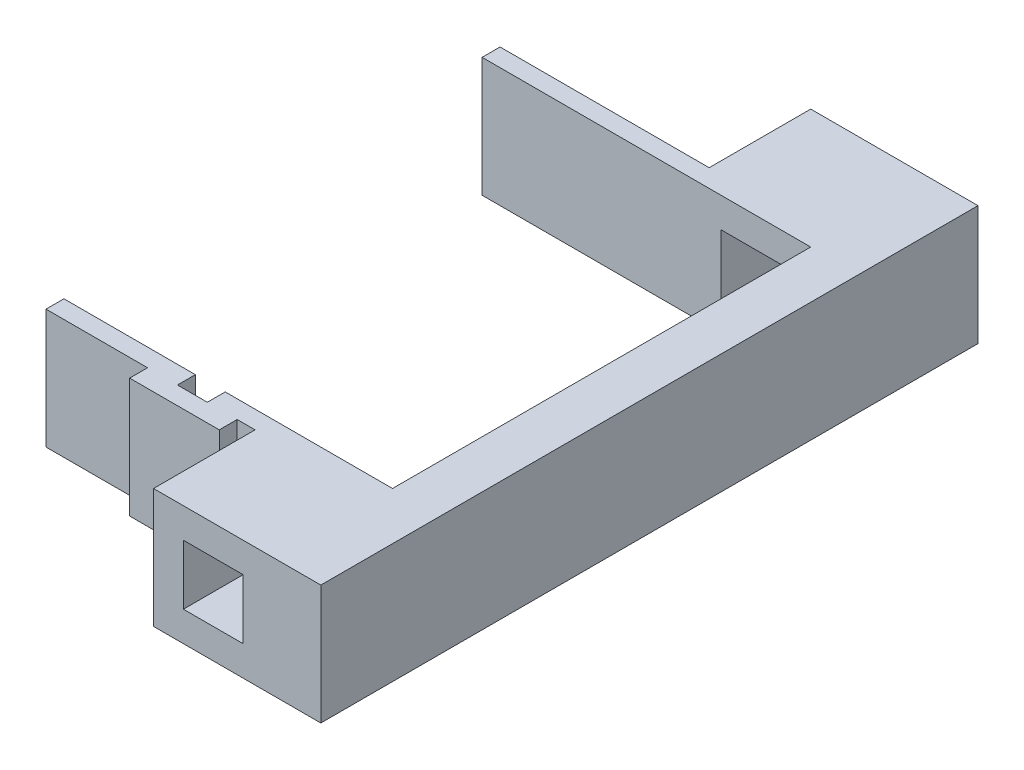
ISO-10303-21;
HEADER;
FILE_DESCRIPTION(('STEP AP214'),'2;1');
FILE_NAME('part.step','',(''),(''),'','','');
FILE_SCHEMA(('AUTOMOTIVE_DESIGN { 1 0 10303 214 1 1 1 1 }'));
ENDSEC;
DATA;
#1=APPLICATION_CONTEXT('core data for automotive mechanical design processes');
#2=APPLICATION_PROTOCOL_DEFINITION('international standard','automotive_design',2000,#1);
#3=PRODUCT_CONTEXT('',#1,'mechanical');
#4=PRODUCT('Part','Part','',(#3));
#5=PRODUCT_RELATED_PRODUCT_CATEGORY('part','',(#4));
#6=PRODUCT_DEFINITION_FORMATION('','',#4);
#7=PRODUCT_DEFINITION_CONTEXT('part definition',#1,'design');
#8=PRODUCT_DEFINITION('design','',#6,#7);
#9=PRODUCT_DEFINITION_SHAPE('','',#8);
#10=(LENGTH_UNIT() NAMED_UNIT(*) SI_UNIT(.MILLI.,.METRE.));
#11=(NAMED_UNIT(*) PLANE_ANGLE_UNIT() SI_UNIT($,.RADIAN.));
#12=(NAMED_UNIT(*) SI_UNIT($,.STERADIAN.) SOLID_ANGLE_UNIT());
#13=UNCERTAINTY_MEASURE_WITH_UNIT(LENGTH_MEASURE(1.E-05),#10,'distance_accuracy_value','');
#14=(GEOMETRIC_REPRESENTATION_CONTEXT(3) GLOBAL_UNCERTAINTY_ASSIGNED_CONTEXT((#13)) GLOBAL_UNIT_ASSIGNED_CONTEXT((#10,
#11,#12)) REPRESENTATION_CONTEXT('',''));
#15=CARTESIAN_POINT('',(0.,0.,0.));
#16=DIRECTION('',(0.,0.,1.));
#17=DIRECTION('',(1.,0.,0.));
#18=AXIS2_PLACEMENT_3D('',#15,#16,#17);
#19=CARTESIAN_POINT('',(-10.,10.,0.));
#20=DIRECTION('',(-1.,0.,0.));
#21=DIRECTION('',(0.,0.,1.));
#22=AXIS2_PLACEMENT_3D('',#19,#20,#21);
#23=PLANE('',#22);
#24=DIRECTION('',(0.,0.,-1.));
#25=VECTOR('',#24,1.);
#26=CARTESIAN_POINT('',(-10.,-10.,0.));
#27=LINE('',#26,#25);
#28=CARTESIAN_POINT('',(-10.,-10.,-38.));
#29=VERTEX_POINT('',#28);
#30=CARTESIAN_POINT('',(-10.,-10.,-55.));
#31=VERTEX_POINT('',#30);
#32=EDGE_CURVE('E313',#29,#31,#27,.T.);
#33=ORIENTED_EDGE('',*,*,#32,.F.);
#34=DIRECTION('',(0.,-1.,0.));
#35=VECTOR('',#34,1.);
#36=CARTESIAN_POINT('',(-10.,10.,-38.));
#37=LINE('',#36,#35);
#38=CARTESIAN_POINT('',(-10.,10.,-38.));
#39=VERTEX_POINT('',#38);
#40=EDGE_CURVE('E129',#39,#29,#37,.T.);
#41=ORIENTED_EDGE('',*,*,#40,.F.);
#42=DIRECTION('',(0.,0.,-1.));
#43=VECTOR('',#42,1.);
#44=CARTESIAN_POINT('',(-10.,10.,0.));
#45=LINE('',#44,#43);
#46=CARTESIAN_POINT('',(-10.,10.,-55.));
#47=VERTEX_POINT('',#46);
#48=EDGE_CURVE('E538',#39,#47,#45,.T.);
#49=ORIENTED_EDGE('',*,*,#48,.T.);
#50=DIRECTION('',(0.,-1.,0.));
#51=VECTOR('',#50,1.);
#52=CARTESIAN_POINT('',(-10.,10.,-55.));
#53=LINE('',#52,#51);
#54=EDGE_CURVE('E122',#47,#31,#53,.T.);
#55=ORIENTED_EDGE('',*,*,#54,.T.);
#56=EDGE_LOOP('',(#33,#41,#49,#55));
#57=FACE_BOUND('',#56,.T.);
#58=ADVANCED_FACE('F113',(#57),#23,.T.);
#59=CARTESIAN_POINT('',(18.,10.,0.));
#60=DIRECTION('',(1.,0.,0.));
#61=DIRECTION('',(0.,0.,-1.));
#62=AXIS2_PLACEMENT_3D('',#59,#60,#61);
#63=PLANE('',#62);
#64=DIRECTION('',(0.,0.,1.));
#65=VECTOR('',#64,1.);
#66=CARTESIAN_POINT('',(18.,-10.,0.));
#67=LINE('',#66,#65);
#68=CARTESIAN_POINT('',(18.,-10.,-55.));
#69=VERTEX_POINT('',#68);
#70=CARTESIAN_POINT('',(18.,-10.,55.));
#71=VERTEX_POINT('',#70);
#72=EDGE_CURVE('E528',#69,#71,#67,.T.);
#73=ORIENTED_EDGE('',*,*,#72,.F.);
#74=DIRECTION('',(0.,-1.,0.));
#75=VECTOR('',#74,1.);
#76=CARTESIAN_POINT('',(18.,10.,-55.));
#77=LINE('',#76,#75);
#78=CARTESIAN_POINT('',(18.,10.,-55.));
#79=VERTEX_POINT('',#78);
#80=EDGE_CURVE('E12',#79,#69,#77,.T.);
#81=ORIENTED_EDGE('',*,*,#80,.F.);
#82=DIRECTION('',(0.,0.,1.));
#83=VECTOR('',#82,1.);
#84=CARTESIAN_POINT('',(18.,10.,0.));
#85=LINE('',#84,#83);
#86=CARTESIAN_POINT('',(18.,10.,55.));
#87=VERTEX_POINT('',#86);
#88=EDGE_CURVE('E529',#79,#87,#85,.T.);
#89=ORIENTED_EDGE('',*,*,#88,.T.);
#90=DIRECTION('',(0.,-1.,0.));
#91=VECTOR('',#90,1.);
#92=CARTESIAN_POINT('',(18.,10.,55.));
#93=LINE('',#92,#91);
#94=EDGE_CURVE('E556',#87,#71,#93,.T.);
#95=ORIENTED_EDGE('',*,*,#94,.T.);
#96=EDGE_LOOP('',(#73,#81,#89,#95));
#97=FACE_BOUND('',#96,.T.);
#98=ADVANCED_FACE('F115',(#97),#63,.T.);
#99=CARTESIAN_POINT('',(0.,10.,-55.));
#100=DIRECTION('',(0.,0.,-1.));
#101=DIRECTION('',(-1.,0.,0.));
#102=AXIS2_PLACEMENT_3D('',#99,#100,#101);
#103=PLANE('',#102);
#104=DIRECTION('',(0.,-1.,0.));
#105=VECTOR('',#104,1.);
#106=CARTESIAN_POINT('',(-4.99999999999991,-5.,-55.));
#107=LINE('',#106,#105);
#108=CARTESIAN_POINT('',(-4.99999999999991,5.,-55.));
#109=VERTEX_POINT('',#108);
#110=CARTESIAN_POINT('',(-4.99999999999991,-5.,-55.));
#111=VERTEX_POINT('',#110);
#112=EDGE_CURVE('E450',#109,#111,#107,.T.);
#113=ORIENTED_EDGE('',*,*,#112,.T.);
#114=DIRECTION('',(1.,0.,0.));
#115=VECTOR('',#114,1.);
#116=CARTESIAN_POINT('',(5.00000000000009,-5.,-55.));
#117=LINE('',#116,#115);
#118=CARTESIAN_POINT('',(5.00000000000009,-5.,-55.));
#119=VERTEX_POINT('',#118);
#120=EDGE_CURVE('E454',#111,#119,#117,.T.);
#121=ORIENTED_EDGE('',*,*,#120,.T.);
#122=DIRECTION('',(0.,1.,0.));
#123=VECTOR('',#122,1.);
#124=CARTESIAN_POINT('',(5.00000000000009,-5.,-55.));
#125=LINE('',#124,#123);
#126=CARTESIAN_POINT('',(5.00000000000009,5.,-55.));
#127=VERTEX_POINT('',#126);
#128=EDGE_CURVE('E459',#119,#127,#125,.T.);
#129=ORIENTED_EDGE('',*,*,#128,.T.);
#130=DIRECTION('',(-1.,0.,0.));
#131=VECTOR('',#130,1.);
#132=CARTESIAN_POINT('',(5.00000000000009,5.,-55.));
#133=LINE('',#132,#131);
#134=EDGE_CURVE('E463',#127,#109,#133,.T.);
#135=ORIENTED_EDGE('',*,*,#134,.T.);
#136=EDGE_LOOP('',(#113,#121,#129,#135));
#137=FACE_BOUND('',#136,.T.);
#138=DIRECTION('',(1.,0.,0.));
#139=VECTOR('',#138,1.);
#140=CARTESIAN_POINT('',(0.,-10.,-55.));
#141=LINE('',#140,#139);
#142=EDGE_CURVE('E559',#31,#69,#141,.T.);
#143=ORIENTED_EDGE('',*,*,#142,.F.);
#144=ORIENTED_EDGE('',*,*,#54,.F.);
#145=DIRECTION('',(1.,0.,0.));
#146=VECTOR('',#145,1.);
#147=CARTESIAN_POINT('',(0.,10.,-55.));
#148=LINE('',#147,#146);
#149=EDGE_CURVE('E533',#47,#79,#148,.T.);
#150=ORIENTED_EDGE('',*,*,#149,.T.);
#151=ORIENTED_EDGE('',*,*,#80,.T.);
#152=EDGE_LOOP('',(#143,#144,#150,#151));
#153=FACE_BOUND('',#152,.T.);
#154=ADVANCED_FACE('F596',(#137,#153),#103,.T.);
#155=CARTESIAN_POINT('',(0.,10.,-35.));
#156=DIRECTION('',(0.,0.,-1.));
#157=DIRECTION('',(-1.,0.,0.));
#158=AXIS2_PLACEMENT_3D('',#155,#156,#157);
#159=PLANE('',#158);
#160=DIRECTION('',(-1.,0.,0.));
#161=VECTOR('',#160,1.);
#162=CARTESIAN_POINT('',(0.,-5.,-35.));
#163=LINE('',#162,#161);
#164=CARTESIAN_POINT('',(5.00000000000009,-5.,-35.));
#165=VERTEX_POINT('',#164);
#166=CARTESIAN_POINT('',(-4.99999999999991,-5.,-35.));
#167=VERTEX_POINT('',#166);
#168=EDGE_CURVE('E502',#165,#167,#163,.T.);
#169=ORIENTED_EDGE('',*,*,#168,.T.);
#170=DIRECTION('',(0.,1.,0.));
#171=VECTOR('',#170,1.);
#172=CARTESIAN_POINT('',(-4.99999999999991,10.,-35.));
#173=LINE('',#172,#171);
#174=CARTESIAN_POINT('',(-4.99999999999991,5.,-35.));
#175=VERTEX_POINT('',#174);
#176=EDGE_CURVE('E524',#167,#175,#173,.T.);
#177=ORIENTED_EDGE('',*,*,#176,.T.);
#178=DIRECTION('',(1.,0.,0.));
#179=VECTOR('',#178,1.);
#180=CARTESIAN_POINT('',(0.,5.,-35.));
#181=LINE('',#180,#179);
#182=CARTESIAN_POINT('',(5.00000000000009,5.,-35.));
#183=VERTEX_POINT('',#182);
#184=EDGE_CURVE('E517',#175,#183,#181,.T.);
#185=ORIENTED_EDGE('',*,*,#184,.T.);
#186=DIRECTION('',(0.,-1.,0.));
#187=VECTOR('',#186,1.);
#188=CARTESIAN_POINT('',(5.00000000000009,10.,-35.));
#189=LINE('',#188,#187);
#190=EDGE_CURVE('E510',#183,#165,#189,.T.);
#191=ORIENTED_EDGE('',*,*,#190,.T.);
#192=EDGE_LOOP('',(#169,#177,#185,#191));
#193=FACE_BOUND('',#192,.T.);
#194=DIRECTION('',(1.,0.,0.));
#195=VECTOR('',#194,1.);
#196=CARTESIAN_POINT('',(0.,-10.,-35.));
#197=LINE('',#196,#195);
#198=CARTESIAN_POINT('',(-45.,-10.,-35.));
#199=VERTEX_POINT('',#198);
#200=CARTESIAN_POINT('',(9.99999999999999,-10.,-35.));
#201=VERTEX_POINT('',#200);
#202=EDGE_CURVE('E301',#199,#201,#197,.T.);
#203=ORIENTED_EDGE('',*,*,#202,.T.);
#204=DIRECTION('',(0.,-1.,0.));
#205=VECTOR('',#204,1.);
#206=CARTESIAN_POINT('',(9.99999999999999,10.,-35.));
#207=LINE('',#206,#205);
#208=CARTESIAN_POINT('',(9.99999999999999,10.,-35.));
#209=VERTEX_POINT('',#208);
#210=EDGE_CURVE('E585',#209,#201,#207,.T.);
#211=ORIENTED_EDGE('',*,*,#210,.F.);
#212=DIRECTION('',(1.,0.,0.));
#213=VECTOR('',#212,1.);
#214=CARTESIAN_POINT('',(0.,10.,-35.));
#215=LINE('',#214,#213);
#216=CARTESIAN_POINT('',(-45.,10.,-35.));
#217=VERTEX_POINT('',#216);
#218=EDGE_CURVE('E318',#217,#209,#215,.T.);
#219=ORIENTED_EDGE('',*,*,#218,.F.);
#220=DIRECTION('',(0.,-1.,0.));
#221=VECTOR('',#220,1.);
#222=CARTESIAN_POINT('',(-45.,10.,-35.));
#223=LINE('',#222,#221);
#224=EDGE_CURVE('E316',#217,#199,#223,.T.);
#225=ORIENTED_EDGE('',*,*,#224,.T.);
#226=EDGE_LOOP('',(#203,#211,#219,#225));
#227=FACE_BOUND('',#226,.T.);
#228=ADVANCED_FACE('F317',(#193,#227),#159,.F.);
#229=CARTESIAN_POINT('',(9.99999999999999,10.,0.));
#230=DIRECTION('',(-1.,0.,0.));
#231=DIRECTION('',(0.,0.,1.));
#232=AXIS2_PLACEMENT_3D('',#229,#230,#231);
#233=PLANE('',#232);
#234=DIRECTION('',(0.,0.,-1.));
#235=VECTOR('',#234,1.);
#236=CARTESIAN_POINT('',(9.99999999999999,-10.,0.));
#237=LINE('',#236,#235);
#238=CARTESIAN_POINT('',(10.,-10.,35.));
#239=VERTEX_POINT('',#238);
#240=EDGE_CURVE('E309',#239,#201,#237,.T.);
#241=ORIENTED_EDGE('',*,*,#240,.F.);
#242=DIRECTION('',(0.,-1.,0.));
#243=VECTOR('',#242,1.);
#244=CARTESIAN_POINT('',(10.,10.,35.));
#245=LINE('',#244,#243);
#246=CARTESIAN_POINT('',(10.,10.,35.));
#247=VERTEX_POINT('',#246);
#248=EDGE_CURVE('E582',#247,#239,#245,.T.);
#249=ORIENTED_EDGE('',*,*,#248,.F.);
#250=DIRECTION('',(0.,0.,-1.));
#251=VECTOR('',#250,1.);
#252=CARTESIAN_POINT('',(9.99999999999999,10.,0.));
#253=LINE('',#252,#251);
#254=EDGE_CURVE('E543',#247,#209,#253,.T.);
#255=ORIENTED_EDGE('',*,*,#254,.T.);
#256=ORIENTED_EDGE('',*,*,#210,.T.);
#257=EDGE_LOOP('',(#241,#249,#255,#256));
#258=FACE_BOUND('',#257,.T.);
#259=ADVANCED_FACE('F660',(#258),#233,.T.);
#260=CARTESIAN_POINT('',(0.,10.,35.));
#261=DIRECTION('',(0.,0.,-1.));
#262=DIRECTION('',(-1.,0.,0.));
#263=AXIS2_PLACEMENT_3D('',#260,#261,#262);
#264=PLANE('',#263);
#265=DIRECTION('',(0.,1.,0.));
#266=VECTOR('',#265,1.);
#267=CARTESIAN_POINT('',(-4.99999999999991,10.,35.));
#268=LINE('',#267,#266);
#269=CARTESIAN_POINT('',(-4.99999999999991,-5.,35.));
#270=VERTEX_POINT('',#269);
#271=CARTESIAN_POINT('',(-4.99999999999991,5.,35.));
#272=VERTEX_POINT('',#271);
#273=EDGE_CURVE('E521',#270,#272,#268,.T.);
#274=ORIENTED_EDGE('',*,*,#273,.F.);
#275=DIRECTION('',(-1.,0.,0.));
#276=VECTOR('',#275,1.);
#277=CARTESIAN_POINT('',(0.,-5.,35.));
#278=LINE('',#277,#276);
#279=CARTESIAN_POINT('',(5.00000000000009,-5.,35.));
#280=VERTEX_POINT('',#279);
#281=EDGE_CURVE('E485',#280,#270,#278,.T.);
#282=ORIENTED_EDGE('',*,*,#281,.F.);
#283=DIRECTION('',(0.,-1.,0.));
#284=VECTOR('',#283,1.);
#285=CARTESIAN_POINT('',(5.00000000000009,10.,35.));
#286=LINE('',#285,#284);
#287=CARTESIAN_POINT('',(5.00000000000009,5.,35.));
#288=VERTEX_POINT('',#287);
#289=EDGE_CURVE('E506',#288,#280,#286,.T.);
#290=ORIENTED_EDGE('',*,*,#289,.F.);
#291=DIRECTION('',(1.,0.,0.));
#292=VECTOR('',#291,1.);
#293=CARTESIAN_POINT('',(0.,5.,35.));
#294=LINE('',#293,#292);
#295=EDGE_CURVE('E514',#272,#288,#294,.T.);
#296=ORIENTED_EDGE('',*,*,#295,.F.);
#297=EDGE_LOOP('',(#274,#282,#290,#296));
#298=FACE_BOUND('',#297,.T.);
#299=DIRECTION('',(1.,0.,0.));
#300=VECTOR('',#299,1.);
#301=CARTESIAN_POINT('',(0.,-10.,35.));
#302=LINE('',#301,#300);
#303=CARTESIAN_POINT('',(-18.,-10.,35.));
#304=VERTEX_POINT('',#303);
#305=EDGE_CURVE('E567',#304,#239,#302,.T.);
#306=ORIENTED_EDGE('',*,*,#305,.F.);
#307=DIRECTION('',(0.,-1.,0.));
#308=VECTOR('',#307,1.);
#309=CARTESIAN_POINT('',(-18.,10.,35.));
#310=LINE('',#309,#308);
#311=CARTESIAN_POINT('',(-18.,10.,35.));
#312=VERTEX_POINT('',#311);
#313=EDGE_CURVE('E439',#312,#304,#310,.T.);
#314=ORIENTED_EDGE('',*,*,#313,.F.);
#315=DIRECTION('',(1.,0.,0.));
#316=VECTOR('',#315,1.);
#317=CARTESIAN_POINT('',(0.,10.,35.));
#318=LINE('',#317,#316);
#319=EDGE_CURVE('E547',#312,#247,#318,.T.);
#320=ORIENTED_EDGE('',*,*,#319,.T.);
#321=ORIENTED_EDGE('',*,*,#248,.T.);
#322=EDGE_LOOP('',(#306,#314,#320,#321));
#323=FACE_BOUND('',#322,.T.);
#324=ADVANCED_FACE('F658',(#298,#323),#264,.T.);
#325=CARTESIAN_POINT('',(-10.,10.,0.));
#326=DIRECTION('',(1.,0.,0.));
#327=DIRECTION('',(0.,0.,-1.));
#328=AXIS2_PLACEMENT_3D('',#325,#326,#327);
#329=PLANE('',#328);
#330=DIRECTION('',(0.,0.,1.));
#331=VECTOR('',#330,1.);
#332=CARTESIAN_POINT('',(-10.,10.,0.));
#333=LINE('',#332,#331);
#334=CARTESIAN_POINT('',(-10.,10.,38.));
#335=VERTEX_POINT('',#334);
#336=CARTESIAN_POINT('',(-10.,10.,55.));
#337=VERTEX_POINT('',#336);
#338=EDGE_CURVE('E137',#335,#337,#333,.T.);
#339=ORIENTED_EDGE('',*,*,#338,.F.);
#340=DIRECTION('',(0.,-1.,0.));
#341=VECTOR('',#340,1.);
#342=CARTESIAN_POINT('',(-10.,10.,38.));
#343=LINE('',#342,#341);
#344=CARTESIAN_POINT('',(-10.,-10.,38.));
#345=VERTEX_POINT('',#344);
#346=EDGE_CURVE('E443',#335,#345,#343,.T.);
#347=ORIENTED_EDGE('',*,*,#346,.T.);
#348=DIRECTION('',(0.,0.,1.));
#349=VECTOR('',#348,1.);
#350=CARTESIAN_POINT('',(-10.,-10.,0.));
#351=LINE('',#350,#349);
#352=CARTESIAN_POINT('',(-10.,-10.,55.));
#353=VERTEX_POINT('',#352);
#354=EDGE_CURVE('E570',#345,#353,#351,.T.);
#355=ORIENTED_EDGE('',*,*,#354,.T.);
#356=DIRECTION('',(0.,-1.,0.));
#357=VECTOR('',#356,1.);
#358=CARTESIAN_POINT('',(-10.,10.,55.));
#359=LINE('',#358,#357);
#360=EDGE_CURVE('E578',#337,#353,#359,.T.);
#361=ORIENTED_EDGE('',*,*,#360,.F.);
#362=EDGE_LOOP('',(#339,#347,#355,#361));
#363=FACE_BOUND('',#362,.T.);
#364=ADVANCED_FACE('F611',(#363),#329,.F.);
#365=CARTESIAN_POINT('',(0.,10.,55.));
#366=DIRECTION('',(0.,0.,-1.));
#367=DIRECTION('',(-1.,0.,0.));
#368=AXIS2_PLACEMENT_3D('',#365,#366,#367);
#369=PLANE('',#368);
#370=DIRECTION('',(1.,0.,0.));
#371=VECTOR('',#370,1.);
#372=CARTESIAN_POINT('',(5.00000000000009,-5.,55.));
#373=LINE('',#372,#371);
#374=CARTESIAN_POINT('',(-4.99999999999991,-5.,55.));
#375=VERTEX_POINT('',#374);
#376=CARTESIAN_POINT('',(5.00000000000009,-5.,55.));
#377=VERTEX_POINT('',#376);
#378=EDGE_CURVE('E470',#375,#377,#373,.T.);
#379=ORIENTED_EDGE('',*,*,#378,.F.);
#380=DIRECTION('',(0.,-1.,0.));
#381=VECTOR('',#380,1.);
#382=CARTESIAN_POINT('',(-4.99999999999991,-5.,55.));
#383=LINE('',#382,#381);
#384=CARTESIAN_POINT('',(-4.99999999999991,5.,55.));
#385=VERTEX_POINT('',#384);
#386=EDGE_CURVE('E449',#385,#375,#383,.T.);
#387=ORIENTED_EDGE('',*,*,#386,.F.);
#388=DIRECTION('',(-1.,0.,0.));
#389=VECTOR('',#388,1.);
#390=CARTESIAN_POINT('',(5.00000000000009,5.,55.));
#391=LINE('',#390,#389);
#392=CARTESIAN_POINT('',(5.00000000000009,5.,55.));
#393=VERTEX_POINT('',#392);
#394=EDGE_CURVE('E455',#393,#385,#391,.T.);
#395=ORIENTED_EDGE('',*,*,#394,.F.);
#396=DIRECTION('',(0.,1.,0.));
#397=VECTOR('',#396,1.);
#398=CARTESIAN_POINT('',(5.00000000000009,-5.,55.));
#399=LINE('',#398,#397);
#400=EDGE_CURVE('E474',#377,#393,#399,.T.);
#401=ORIENTED_EDGE('',*,*,#400,.F.);
#402=EDGE_LOOP('',(#379,#387,#395,#401));
#403=FACE_BOUND('',#402,.T.);
#404=DIRECTION('',(1.,0.,0.));
#405=VECTOR('',#404,1.);
#406=CARTESIAN_POINT('',(0.,-10.,55.));
#407=LINE('',#406,#405);
#408=EDGE_CURVE('E534',#353,#71,#407,.T.);
#409=ORIENTED_EDGE('',*,*,#408,.T.);
#410=ORIENTED_EDGE('',*,*,#94,.F.);
#411=DIRECTION('',(1.,0.,0.));
#412=VECTOR('',#411,1.);
#413=CARTESIAN_POINT('',(0.,10.,55.));
#414=LINE('',#413,#412);
#415=EDGE_CURVE('E553',#337,#87,#414,.T.);
#416=ORIENTED_EDGE('',*,*,#415,.F.);
#417=ORIENTED_EDGE('',*,*,#360,.T.);
#418=EDGE_LOOP('',(#409,#410,#416,#417));
#419=FACE_BOUND('',#418,.T.);
#420=ADVANCED_FACE('F609',(#403,#419),#369,.F.);
#421=CARTESIAN_POINT('',(0.,10.,0.));
#422=DIRECTION('',(0.,1.,0.));
#423=DIRECTION('',(0.,0.,1.));
#424=AXIS2_PLACEMENT_3D('',#421,#422,#423);
#425=PLANE('',#424);
#426=ORIENTED_EDGE('',*,*,#88,.F.);
#427=ORIENTED_EDGE('',*,*,#149,.F.);
#428=ORIENTED_EDGE('',*,*,#48,.F.);
#429=DIRECTION('',(-1.,0.,0.));
#430=VECTOR('',#429,1.);
#431=CARTESIAN_POINT('',(-10.,10.,-38.));
#432=LINE('',#431,#430);
#433=CARTESIAN_POINT('',(-45.,10.,-38.));
#434=VERTEX_POINT('',#433);
#435=EDGE_CURVE('E330',#39,#434,#432,.T.);
#436=ORIENTED_EDGE('',*,*,#435,.T.);
#437=DIRECTION('',(0.,0.,-1.));
#438=VECTOR('',#437,1.);
#439=CARTESIAN_POINT('',(-45.,10.,-35.));
#440=LINE('',#439,#438);
#441=EDGE_CURVE('E323',#217,#434,#440,.T.);
#442=ORIENTED_EDGE('',*,*,#441,.F.);
#443=ORIENTED_EDGE('',*,*,#218,.T.);
#444=ORIENTED_EDGE('',*,*,#254,.F.);
#445=ORIENTED_EDGE('',*,*,#319,.F.);
#446=DIRECTION('',(0.,0.,1.));
#447=VECTOR('',#446,1.);
#448=CARTESIAN_POINT('',(-18.,10.,0.));
#449=LINE('',#448,#447);
#450=CARTESIAN_POINT('',(-18.,10.,38.));
#451=VERTEX_POINT('',#450);
#452=EDGE_CURVE('E350',#312,#451,#449,.T.);
#453=ORIENTED_EDGE('',*,*,#452,.T.);
#454=DIRECTION('',(1.,0.,0.));
#455=VECTOR('',#454,1.);
#456=CARTESIAN_POINT('',(0.,10.,38.));
#457=LINE('',#456,#455);
#458=CARTESIAN_POINT('',(-23.,10.,38.));
#459=VERTEX_POINT('',#458);
#460=EDGE_CURVE('E353',#459,#451,#457,.T.);
#461=ORIENTED_EDGE('',*,*,#460,.F.);
#462=DIRECTION('',(0.,0.,1.));
#463=VECTOR('',#462,1.);
#464=CARTESIAN_POINT('',(-23.,10.,0.));
#465=LINE('',#464,#463);
#466=CARTESIAN_POINT('',(-23.,10.,35.));
#467=VERTEX_POINT('',#466);
#468=EDGE_CURVE('E357',#467,#459,#465,.T.);
#469=ORIENTED_EDGE('',*,*,#468,.F.);
#470=DIRECTION('',(-1.,0.,0.));
#471=VECTOR('',#470,1.);
#472=CARTESIAN_POINT('',(0.,10.,35.));
#473=LINE('',#472,#471);
#474=CARTESIAN_POINT('',(-45.,10.,35.));
#475=VERTEX_POINT('',#474);
#476=EDGE_CURVE('E361',#467,#475,#473,.T.);
#477=ORIENTED_EDGE('',*,*,#476,.T.);
#478=DIRECTION('',(0.,0.,1.));
#479=VECTOR('',#478,1.);
#480=CARTESIAN_POINT('',(-45.,10.,0.));
#481=LINE('',#480,#479);
#482=CARTESIAN_POINT('',(-45.,10.,38.));
#483=VERTEX_POINT('',#482);
#484=EDGE_CURVE('E364',#475,#483,#481,.T.);
#485=ORIENTED_EDGE('',*,*,#484,.T.);
#486=DIRECTION('',(-1.,0.,0.));
#487=VECTOR('',#486,1.);
#488=CARTESIAN_POINT('',(0.,10.,38.));
#489=LINE('',#488,#487);
#490=CARTESIAN_POINT('',(-28.,10.,38.));
#491=VERTEX_POINT('',#490);
#492=EDGE_CURVE('E367',#491,#483,#489,.T.);
#493=ORIENTED_EDGE('',*,*,#492,.F.);
#494=DIRECTION('',(0.,0.,1.));
#495=VECTOR('',#494,1.);
#496=CARTESIAN_POINT('',(-28.,10.,0.));
#497=LINE('',#496,#495);
#498=CARTESIAN_POINT('',(-28.,10.,41.));
#499=VERTEX_POINT('',#498);
#500=EDGE_CURVE('E371',#491,#499,#497,.T.);
#501=ORIENTED_EDGE('',*,*,#500,.T.);
#502=DIRECTION('',(1.,0.,0.));
#503=VECTOR('',#502,1.);
#504=CARTESIAN_POINT('',(0.,10.,41.));
#505=LINE('',#504,#503);
#506=CARTESIAN_POINT('',(-13.,10.,41.));
#507=VERTEX_POINT('',#506);
#508=EDGE_CURVE('E374',#499,#507,#505,.T.);
#509=ORIENTED_EDGE('',*,*,#508,.T.);
#510=DIRECTION('',(0.,0.,1.));
#511=VECTOR('',#510,1.);
#512=CARTESIAN_POINT('',(-13.,10.,0.));
#513=LINE('',#512,#511);
#514=CARTESIAN_POINT('',(-13.,10.,38.));
#515=VERTEX_POINT('',#514);
#516=EDGE_CURVE('E341',#515,#507,#513,.T.);
#517=ORIENTED_EDGE('',*,*,#516,.F.);
#518=DIRECTION('',(-1.,0.,0.));
#519=VECTOR('',#518,1.);
#520=CARTESIAN_POINT('',(0.,10.,38.));
#521=LINE('',#520,#519);
#522=EDGE_CURVE('E345',#335,#515,#521,.T.);
#523=ORIENTED_EDGE('',*,*,#522,.F.);
#524=ORIENTED_EDGE('',*,*,#338,.T.);
#525=ORIENTED_EDGE('',*,*,#415,.T.);
#526=EDGE_LOOP('',(#426,#427,#428,#436,#442,#443,#444,#445,#453,#461,#469,#477,#485,#493,#501,
#509,#517,#523,#524,#525));
#527=FACE_BOUND('',#526,.T.);
#528=ADVANCED_FACE('F603',(#527),#425,.T.);
#529=CARTESIAN_POINT('',(0.,-10.,0.));
#530=DIRECTION('',(0.,1.,0.));
#531=DIRECTION('',(0.,0.,1.));
#532=AXIS2_PLACEMENT_3D('',#529,#530,#531);
#533=PLANE('',#532);
#534=ORIENTED_EDGE('',*,*,#72,.T.);
#535=ORIENTED_EDGE('',*,*,#408,.F.);
#536=ORIENTED_EDGE('',*,*,#354,.F.);
#537=DIRECTION('',(-1.,0.,0.));
#538=VECTOR('',#537,1.);
#539=CARTESIAN_POINT('',(0.,-10.,38.));
#540=LINE('',#539,#538);
#541=CARTESIAN_POINT('',(-13.,-10.,38.));
#542=VERTEX_POINT('',#541);
#543=EDGE_CURVE('E381',#345,#542,#540,.T.);
#544=ORIENTED_EDGE('',*,*,#543,.T.);
#545=DIRECTION('',(0.,0.,1.));
#546=VECTOR('',#545,1.);
#547=CARTESIAN_POINT('',(-13.,-10.,0.));
#548=LINE('',#547,#546);
#549=CARTESIAN_POINT('',(-13.,-10.,41.));
#550=VERTEX_POINT('',#549);
#551=EDGE_CURVE('E334',#542,#550,#548,.T.);
#552=ORIENTED_EDGE('',*,*,#551,.T.);
#553=DIRECTION('',(1.,0.,0.));
#554=VECTOR('',#553,1.);
#555=CARTESIAN_POINT('',(0.,-10.,41.));
#556=LINE('',#555,#554);
#557=CARTESIAN_POINT('',(-28.,-10.,41.));
#558=VERTEX_POINT('',#557);
#559=EDGE_CURVE('E346',#558,#550,#556,.T.);
#560=ORIENTED_EDGE('',*,*,#559,.F.);
#561=DIRECTION('',(0.,0.,1.));
#562=VECTOR('',#561,1.);
#563=CARTESIAN_POINT('',(-28.,-10.,0.));
#564=LINE('',#563,#562);
#565=CARTESIAN_POINT('',(-28.,-10.,38.));
#566=VERTEX_POINT('',#565);
#567=EDGE_CURVE('E408',#566,#558,#564,.T.);
#568=ORIENTED_EDGE('',*,*,#567,.F.);
#569=DIRECTION('',(-1.,0.,0.));
#570=VECTOR('',#569,1.);
#571=CARTESIAN_POINT('',(0.,-10.,38.));
#572=LINE('',#571,#570);
#573=CARTESIAN_POINT('',(-45.,-10.,38.));
#574=VERTEX_POINT('',#573);
#575=EDGE_CURVE('E404',#566,#574,#572,.T.);
#576=ORIENTED_EDGE('',*,*,#575,.T.);
#577=DIRECTION('',(0.,0.,1.));
#578=VECTOR('',#577,1.);
#579=CARTESIAN_POINT('',(-45.,-10.,0.));
#580=LINE('',#579,#578);
#581=CARTESIAN_POINT('',(-45.,-10.,35.));
#582=VERTEX_POINT('',#581);
#583=EDGE_CURVE('E400',#582,#574,#580,.T.);
#584=ORIENTED_EDGE('',*,*,#583,.F.);
#585=DIRECTION('',(-1.,0.,0.));
#586=VECTOR('',#585,1.);
#587=CARTESIAN_POINT('',(0.,-10.,35.));
#588=LINE('',#587,#586);
#589=CARTESIAN_POINT('',(-23.,-10.,35.));
#590=VERTEX_POINT('',#589);
#591=EDGE_CURVE('E397',#590,#582,#588,.T.);
#592=ORIENTED_EDGE('',*,*,#591,.F.);
#593=DIRECTION('',(0.,0.,1.));
#594=VECTOR('',#593,1.);
#595=CARTESIAN_POINT('',(-23.,-10.,0.));
#596=LINE('',#595,#594);
#597=CARTESIAN_POINT('',(-23.,-10.,38.));
#598=VERTEX_POINT('',#597);
#599=EDGE_CURVE('E393',#590,#598,#596,.T.);
#600=ORIENTED_EDGE('',*,*,#599,.T.);
#601=DIRECTION('',(1.,0.,0.));
#602=VECTOR('',#601,1.);
#603=CARTESIAN_POINT('',(0.,-10.,38.));
#604=LINE('',#603,#602);
#605=CARTESIAN_POINT('',(-18.,-10.,38.));
#606=VERTEX_POINT('',#605);
#607=EDGE_CURVE('E389',#598,#606,#604,.T.);
#608=ORIENTED_EDGE('',*,*,#607,.T.);
#609=DIRECTION('',(0.,0.,1.));
#610=VECTOR('',#609,1.);
#611=CARTESIAN_POINT('',(-18.,-10.,0.));
#612=LINE('',#611,#610);
#613=EDGE_CURVE('E385',#304,#606,#612,.T.);
#614=ORIENTED_EDGE('',*,*,#613,.F.);
#615=ORIENTED_EDGE('',*,*,#305,.T.);
#616=ORIENTED_EDGE('',*,*,#240,.T.);
#617=ORIENTED_EDGE('',*,*,#202,.F.);
#618=DIRECTION('',(0.,0.,-1.));
#619=VECTOR('',#618,1.);
#620=CARTESIAN_POINT('',(-45.,-10.,-35.));
#621=LINE('',#620,#619);
#622=CARTESIAN_POINT('',(-45.,-10.,-38.));
#623=VERTEX_POINT('',#622);
#624=EDGE_CURVE('E306',#199,#623,#621,.T.);
#625=ORIENTED_EDGE('',*,*,#624,.T.);
#626=DIRECTION('',(-1.,0.,0.));
#627=VECTOR('',#626,1.);
#628=CARTESIAN_POINT('',(-10.,-10.,-38.));
#629=LINE('',#628,#627);
#630=EDGE_CURVE('E329',#29,#623,#629,.T.);
#631=ORIENTED_EDGE('',*,*,#630,.F.);
#632=ORIENTED_EDGE('',*,*,#32,.T.);
#633=ORIENTED_EDGE('',*,*,#142,.T.);
#634=EDGE_LOOP('',(#534,#535,#536,#544,#552,#560,#568,#576,#584,#592,#600,#608,#614,#615,#616,
#617,#625,#631,#632,#633));
#635=FACE_BOUND('',#634,.T.);
#636=ADVANCED_FACE('F304',(#635),#533,.F.);
#637=CARTESIAN_POINT('',(5.00000000000009,-5.,-55.));
#638=DIRECTION('',(0.,-1.,0.));
#639=DIRECTION('',(1.,0.,0.));
#640=AXIS2_PLACEMENT_3D('',#637,#638,#639);
#641=PLANE('',#640);
#642=ORIENTED_EDGE('',*,*,#281,.T.);
#643=DIRECTION('',(0.,0.,1.));
#644=VECTOR('',#643,1.);
#645=CARTESIAN_POINT('',(-4.99999999999991,-5.,-55.));
#646=LINE('',#645,#644);
#647=EDGE_CURVE('E467',#270,#375,#646,.T.);
#648=ORIENTED_EDGE('',*,*,#647,.T.);
#649=ORIENTED_EDGE('',*,*,#378,.T.);
#650=DIRECTION('',(0.,0.,1.));
#651=VECTOR('',#650,1.);
#652=CARTESIAN_POINT('',(5.00000000000009,-5.,-55.));
#653=LINE('',#652,#651);
#654=EDGE_CURVE('E496',#280,#377,#653,.T.);
#655=ORIENTED_EDGE('',*,*,#654,.F.);
#656=EDGE_LOOP('',(#642,#648,#649,#655));
#657=FACE_BOUND('',#656,.T.);
#658=ADVANCED_FACE('F712',(#657),#641,.F.);
#659=CARTESIAN_POINT('',(5.00000000000009,-5.,-55.));
#660=DIRECTION('',(1.,0.,0.));
#661=DIRECTION('',(0.,0.,-1.));
#662=AXIS2_PLACEMENT_3D('',#659,#660,#661);
#663=PLANE('',#662);
#664=ORIENTED_EDGE('',*,*,#289,.T.);
#665=ORIENTED_EDGE('',*,*,#654,.T.);
#666=ORIENTED_EDGE('',*,*,#400,.T.);
#667=DIRECTION('',(0.,0.,1.));
#668=VECTOR('',#667,1.);
#669=CARTESIAN_POINT('',(5.00000000000009,5.,-55.));
#670=LINE('',#669,#668);
#671=EDGE_CURVE('E491',#288,#393,#670,.T.);
#672=ORIENTED_EDGE('',*,*,#671,.F.);
#673=EDGE_LOOP('',(#664,#665,#666,#672));
#674=FACE_BOUND('',#673,.T.);
#675=ADVANCED_FACE('F701',(#674),#663,.F.);
#676=CARTESIAN_POINT('',(5.00000000000009,5.,-55.));
#677=DIRECTION('',(0.,1.,0.));
#678=DIRECTION('',(-1.,0.,0.));
#679=AXIS2_PLACEMENT_3D('',#676,#677,#678);
#680=PLANE('',#679);
#681=ORIENTED_EDGE('',*,*,#295,.T.);
#682=ORIENTED_EDGE('',*,*,#671,.T.);
#683=ORIENTED_EDGE('',*,*,#394,.T.);
#684=DIRECTION('',(0.,0.,1.));
#685=VECTOR('',#684,1.);
#686=CARTESIAN_POINT('',(-4.99999999999991,5.,-55.));
#687=LINE('',#686,#685);
#688=EDGE_CURVE('E486',#272,#385,#687,.T.);
#689=ORIENTED_EDGE('',*,*,#688,.F.);
#690=EDGE_LOOP('',(#681,#682,#683,#689));
#691=FACE_BOUND('',#690,.T.);
#692=ADVANCED_FACE('F695',(#691),#680,.F.);
#693=CARTESIAN_POINT('',(-4.99999999999991,-5.,-55.));
#694=DIRECTION('',(-1.,0.,0.));
#695=DIRECTION('',(0.,0.,1.));
#696=AXIS2_PLACEMENT_3D('',#693,#694,#695);
#697=PLANE('',#696);
#698=ORIENTED_EDGE('',*,*,#273,.T.);
#699=ORIENTED_EDGE('',*,*,#688,.T.);
#700=ORIENTED_EDGE('',*,*,#386,.T.);
#701=ORIENTED_EDGE('',*,*,#647,.F.);
#702=EDGE_LOOP('',(#698,#699,#700,#701));
#703=FACE_BOUND('',#702,.T.);
#704=ADVANCED_FACE('F702',(#703),#697,.F.);
#705=EDGE_CURVE('E497',#111,#167,#646,.T.);
#706=ORIENTED_EDGE('',*,*,#705,.F.);
#707=ORIENTED_EDGE('',*,*,#112,.F.);
#708=EDGE_CURVE('E481',#109,#175,#687,.T.);
#709=ORIENTED_EDGE('',*,*,#708,.T.);
#710=ORIENTED_EDGE('',*,*,#176,.F.);
#711=EDGE_LOOP('',(#706,#707,#709,#710));
#712=FACE_BOUND('',#711,.T.);
#713=ADVANCED_FACE('F684',(#712),#697,.F.);
#714=ORIENTED_EDGE('',*,*,#708,.F.);
#715=ORIENTED_EDGE('',*,*,#134,.F.);
#716=EDGE_CURVE('E487',#127,#183,#670,.T.);
#717=ORIENTED_EDGE('',*,*,#716,.T.);
#718=ORIENTED_EDGE('',*,*,#184,.F.);
#719=EDGE_LOOP('',(#714,#715,#717,#718));
#720=FACE_BOUND('',#719,.T.);
#721=ADVANCED_FACE('F692',(#720),#680,.F.);
#722=ORIENTED_EDGE('',*,*,#716,.F.);
#723=ORIENTED_EDGE('',*,*,#128,.F.);
#724=EDGE_CURVE('E492',#119,#165,#653,.T.);
#725=ORIENTED_EDGE('',*,*,#724,.T.);
#726=ORIENTED_EDGE('',*,*,#190,.F.);
#727=EDGE_LOOP('',(#722,#723,#725,#726));
#728=FACE_BOUND('',#727,.T.);
#729=ADVANCED_FACE('F690',(#728),#663,.F.);
#730=ORIENTED_EDGE('',*,*,#724,.F.);
#731=ORIENTED_EDGE('',*,*,#120,.F.);
#732=ORIENTED_EDGE('',*,*,#705,.T.);
#733=ORIENTED_EDGE('',*,*,#168,.F.);
#734=EDGE_LOOP('',(#730,#731,#732,#733));
#735=FACE_BOUND('',#734,.T.);
#736=ADVANCED_FACE('F688',(#735),#641,.F.);
#737=CARTESIAN_POINT('',(0.,10.,38.));
#738=DIRECTION('',(0.,0.,1.));
#739=DIRECTION('',(1.,0.,0.));
#740=AXIS2_PLACEMENT_3D('',#737,#738,#739);
#741=PLANE('',#740);
#742=ORIENTED_EDGE('',*,*,#543,.F.);
#743=ORIENTED_EDGE('',*,*,#346,.F.);
#744=ORIENTED_EDGE('',*,*,#522,.T.);
#745=DIRECTION('',(0.,-1.,0.));
#746=VECTOR('',#745,1.);
#747=CARTESIAN_POINT('',(-13.,10.,38.));
#748=LINE('',#747,#746);
#749=EDGE_CURVE('E446',#515,#542,#748,.T.);
#750=ORIENTED_EDGE('',*,*,#749,.T.);
#751=EDGE_LOOP('',(#742,#743,#744,#750));
#752=FACE_BOUND('',#751,.T.);
#753=ADVANCED_FACE('F614',(#752),#741,.T.);
#754=CARTESIAN_POINT('',(-18.,10.,0.));
#755=DIRECTION('',(1.,0.,0.));
#756=DIRECTION('',(0.,0.,-1.));
#757=AXIS2_PLACEMENT_3D('',#754,#755,#756);
#758=PLANE('',#757);
#759=ORIENTED_EDGE('',*,*,#613,.T.);
#760=DIRECTION('',(0.,-1.,0.));
#761=VECTOR('',#760,1.);
#762=CARTESIAN_POINT('',(-18.,10.,38.));
#763=LINE('',#762,#761);
#764=EDGE_CURVE('E436',#451,#606,#763,.T.);
#765=ORIENTED_EDGE('',*,*,#764,.F.);
#766=ORIENTED_EDGE('',*,*,#452,.F.);
#767=ORIENTED_EDGE('',*,*,#313,.T.);
#768=EDGE_LOOP('',(#759,#765,#766,#767));
#769=FACE_BOUND('',#768,.T.);
#770=ADVANCED_FACE('F655',(#769),#758,.F.);
#771=CARTESIAN_POINT('',(0.,10.,38.));
#772=DIRECTION('',(0.,0.,-1.));
#773=DIRECTION('',(-1.,0.,0.));
#774=AXIS2_PLACEMENT_3D('',#771,#772,#773);
#775=PLANE('',#774);
#776=ORIENTED_EDGE('',*,*,#607,.F.);
#777=DIRECTION('',(0.,-1.,0.));
#778=VECTOR('',#777,1.);
#779=CARTESIAN_POINT('',(-23.,10.,38.));
#780=LINE('',#779,#778);
#781=EDGE_CURVE('E433',#459,#598,#780,.T.);
#782=ORIENTED_EDGE('',*,*,#781,.F.);
#783=ORIENTED_EDGE('',*,*,#460,.T.);
#784=ORIENTED_EDGE('',*,*,#764,.T.);
#785=EDGE_LOOP('',(#776,#782,#783,#784));
#786=FACE_BOUND('',#785,.T.);
#787=ADVANCED_FACE('F650',(#786),#775,.T.);
#788=CARTESIAN_POINT('',(-23.,10.,0.));
#789=DIRECTION('',(1.,0.,0.));
#790=DIRECTION('',(0.,0.,-1.));
#791=AXIS2_PLACEMENT_3D('',#788,#789,#790);
#792=PLANE('',#791);
#793=ORIENTED_EDGE('',*,*,#599,.F.);
#794=DIRECTION('',(0.,-1.,0.));
#795=VECTOR('',#794,1.);
#796=CARTESIAN_POINT('',(-23.,10.,35.));
#797=LINE('',#796,#795);
#798=EDGE_CURVE('E430',#467,#590,#797,.T.);
#799=ORIENTED_EDGE('',*,*,#798,.F.);
#800=ORIENTED_EDGE('',*,*,#468,.T.);
#801=ORIENTED_EDGE('',*,*,#781,.T.);
#802=EDGE_LOOP('',(#793,#799,#800,#801));
#803=FACE_BOUND('',#802,.T.);
#804=ADVANCED_FACE('F646',(#803),#792,.T.);
#805=CARTESIAN_POINT('',(0.,10.,35.));
#806=DIRECTION('',(0.,0.,1.));
#807=DIRECTION('',(1.,0.,0.));
#808=AXIS2_PLACEMENT_3D('',#805,#806,#807);
#809=PLANE('',#808);
#810=ORIENTED_EDGE('',*,*,#591,.T.);
#811=DIRECTION('',(0.,-1.,0.));
#812=VECTOR('',#811,1.);
#813=CARTESIAN_POINT('',(-45.,10.,35.));
#814=LINE('',#813,#812);
#815=EDGE_CURVE('E426',#475,#582,#814,.T.);
#816=ORIENTED_EDGE('',*,*,#815,.F.);
#817=ORIENTED_EDGE('',*,*,#476,.F.);
#818=ORIENTED_EDGE('',*,*,#798,.T.);
#819=EDGE_LOOP('',(#810,#816,#817,#818));
#820=FACE_BOUND('',#819,.T.);
#821=ADVANCED_FACE('F643',(#820),#809,.F.);
#822=CARTESIAN_POINT('',(-45.,10.,0.));
#823=DIRECTION('',(1.,0.,0.));
#824=DIRECTION('',(0.,0.,-1.));
#825=AXIS2_PLACEMENT_3D('',#822,#823,#824);
#826=PLANE('',#825);
#827=ORIENTED_EDGE('',*,*,#583,.T.);
#828=DIRECTION('',(0.,-1.,0.));
#829=VECTOR('',#828,1.);
#830=CARTESIAN_POINT('',(-45.,10.,38.));
#831=LINE('',#830,#829);
#832=EDGE_CURVE('E423',#483,#574,#831,.T.);
#833=ORIENTED_EDGE('',*,*,#832,.F.);
#834=ORIENTED_EDGE('',*,*,#484,.F.);
#835=ORIENTED_EDGE('',*,*,#815,.T.);
#836=EDGE_LOOP('',(#827,#833,#834,#835));
#837=FACE_BOUND('',#836,.T.);
#838=ADVANCED_FACE('F638',(#837),#826,.F.);
#839=CARTESIAN_POINT('',(0.,10.,38.));
#840=DIRECTION('',(0.,0.,1.));
#841=DIRECTION('',(1.,0.,0.));
#842=AXIS2_PLACEMENT_3D('',#839,#840,#841);
#843=PLANE('',#842);
#844=ORIENTED_EDGE('',*,*,#575,.F.);
#845=DIRECTION('',(0.,-1.,0.));
#846=VECTOR('',#845,1.);
#847=CARTESIAN_POINT('',(-28.,10.,38.));
#848=LINE('',#847,#846);
#849=EDGE_CURVE('E420',#491,#566,#848,.T.);
#850=ORIENTED_EDGE('',*,*,#849,.F.);
#851=ORIENTED_EDGE('',*,*,#492,.T.);
#852=ORIENTED_EDGE('',*,*,#832,.T.);
#853=EDGE_LOOP('',(#844,#850,#851,#852));
#854=FACE_BOUND('',#853,.T.);
#855=ADVANCED_FACE('F632',(#854),#843,.T.);
#856=CARTESIAN_POINT('',(-28.,10.,0.));
#857=DIRECTION('',(1.,0.,0.));
#858=DIRECTION('',(0.,0.,-1.));
#859=AXIS2_PLACEMENT_3D('',#856,#857,#858);
#860=PLANE('',#859);
#861=ORIENTED_EDGE('',*,*,#567,.T.);
#862=DIRECTION('',(0.,-1.,0.));
#863=VECTOR('',#862,1.);
#864=CARTESIAN_POINT('',(-28.,10.,41.));
#865=LINE('',#864,#863);
#866=EDGE_CURVE('E416',#499,#558,#865,.T.);
#867=ORIENTED_EDGE('',*,*,#866,.F.);
#868=ORIENTED_EDGE('',*,*,#500,.F.);
#869=ORIENTED_EDGE('',*,*,#849,.T.);
#870=EDGE_LOOP('',(#861,#867,#868,#869));
#871=FACE_BOUND('',#870,.T.);
#872=ADVANCED_FACE('F629',(#871),#860,.F.);
#873=CARTESIAN_POINT('',(0.,10.,41.));
#874=DIRECTION('',(0.,0.,-1.));
#875=DIRECTION('',(-1.,0.,0.));
#876=AXIS2_PLACEMENT_3D('',#873,#874,#875);
#877=PLANE('',#876);
#878=ORIENTED_EDGE('',*,*,#559,.T.);
#879=DIRECTION('',(0.,-1.,0.));
#880=VECTOR('',#879,1.);
#881=CARTESIAN_POINT('',(-13.,10.,41.));
#882=LINE('',#881,#880);
#883=EDGE_CURVE('E377',#507,#550,#882,.T.);
#884=ORIENTED_EDGE('',*,*,#883,.F.);
#885=ORIENTED_EDGE('',*,*,#508,.F.);
#886=ORIENTED_EDGE('',*,*,#866,.T.);
#887=EDGE_LOOP('',(#878,#884,#885,#886));
#888=FACE_BOUND('',#887,.T.);
#889=ADVANCED_FACE('F624',(#888),#877,.F.);
#890=CARTESIAN_POINT('',(-13.,10.,0.));
#891=DIRECTION('',(1.,0.,0.));
#892=DIRECTION('',(0.,0.,-1.));
#893=AXIS2_PLACEMENT_3D('',#890,#891,#892);
#894=PLANE('',#893);
#895=ORIENTED_EDGE('',*,*,#551,.F.);
#896=ORIENTED_EDGE('',*,*,#749,.F.);
#897=ORIENTED_EDGE('',*,*,#516,.T.);
#898=ORIENTED_EDGE('',*,*,#883,.T.);
#899=EDGE_LOOP('',(#895,#896,#897,#898));
#900=FACE_BOUND('',#899,.T.);
#901=ADVANCED_FACE('F618',(#900),#894,.T.);
#902=CARTESIAN_POINT('',(-10.,10.,-38.));
#903=DIRECTION('',(0.,0.,1.));
#904=DIRECTION('',(1.,0.,0.));
#905=AXIS2_PLACEMENT_3D('',#902,#903,#904);
#906=PLANE('',#905);
#907=ORIENTED_EDGE('',*,*,#630,.T.);
#908=DIRECTION('',(0.,-1.,0.));
#909=VECTOR('',#908,1.);
#910=CARTESIAN_POINT('',(-45.,10.,-38.));
#911=LINE('',#910,#909);
#912=EDGE_CURVE('E324',#434,#623,#911,.T.);
#913=ORIENTED_EDGE('',*,*,#912,.F.);
#914=ORIENTED_EDGE('',*,*,#435,.F.);
#915=ORIENTED_EDGE('',*,*,#40,.T.);
#916=EDGE_LOOP('',(#907,#913,#914,#915));
#917=FACE_BOUND('',#916,.T.);
#918=ADVANCED_FACE('F599',(#917),#906,.F.);
#919=CARTESIAN_POINT('',(-45.,10.,-35.));
#920=DIRECTION('',(-1.,0.,0.));
#921=DIRECTION('',(0.,0.,1.));
#922=AXIS2_PLACEMENT_3D('',#919,#920,#921);
#923=PLANE('',#922);
#924=ORIENTED_EDGE('',*,*,#624,.F.);
#925=ORIENTED_EDGE('',*,*,#224,.F.);
#926=ORIENTED_EDGE('',*,*,#441,.T.);
#927=ORIENTED_EDGE('',*,*,#912,.T.);
#928=EDGE_LOOP('',(#924,#925,#926,#927));
#929=FACE_BOUND('',#928,.T.);
#930=ADVANCED_FACE('F326',(#929),#923,.T.);
#931=CLOSED_SHELL('',(#58,#98,#154,#228,#259,#324,#364,#420,#528,#636,#658,#675,#692,#704,#713,
#721,#729,#736,#753,#770,#787,#804,#821,#838,#855,#872,#889,#901,#918,#930));
#932=MANIFOLD_SOLID_BREP('B2',#931);
#933=ADVANCED_BREP_SHAPE_REPRESENTATION('',(#18,#932),#14);
#934=SHAPE_DEFINITION_REPRESENTATION(#9,#933);
ENDSEC;
END-ISO-10303-21;
